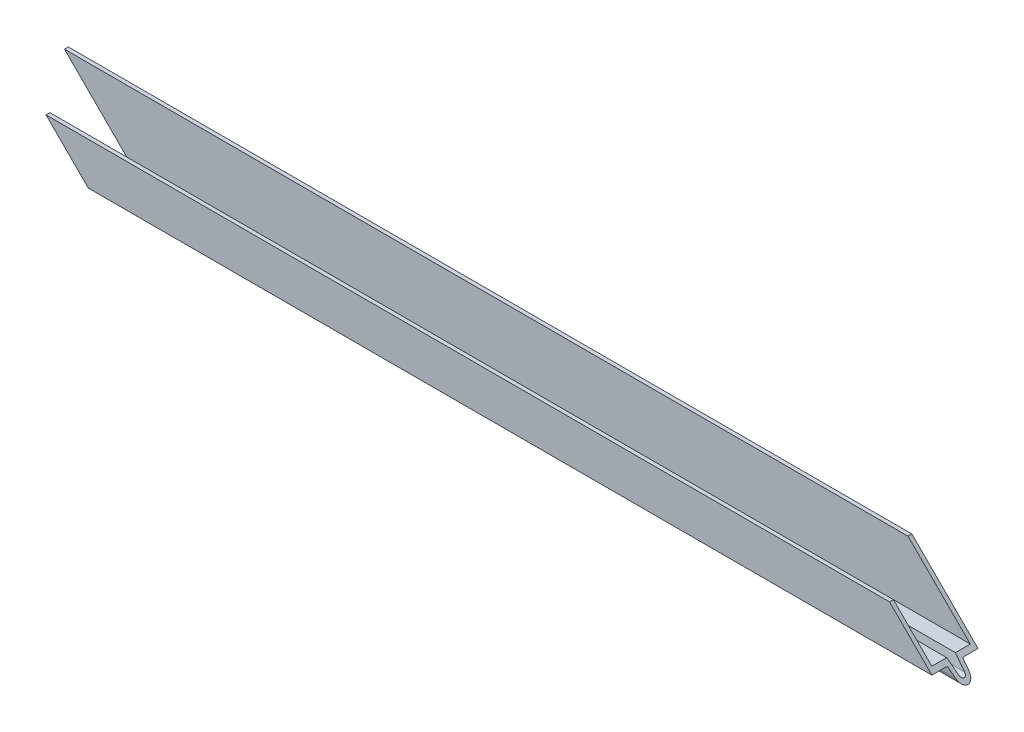
ISO-10303-21;
HEADER;
FILE_DESCRIPTION(('STEP AP214'),'2;1');
FILE_NAME('part.step','',(''),(''),'','','');
FILE_SCHEMA(('AUTOMOTIVE_DESIGN { 1 0 10303 214 1 1 1 1 }'));
ENDSEC;
DATA;
#1=APPLICATION_CONTEXT('core data for automotive mechanical design processes');
#2=APPLICATION_PROTOCOL_DEFINITION('international standard','automotive_design',2000,#1);
#3=PRODUCT_CONTEXT('',#1,'mechanical');
#4=PRODUCT('Part','Part','',(#3));
#5=PRODUCT_RELATED_PRODUCT_CATEGORY('part','',(#4));
#6=PRODUCT_DEFINITION_FORMATION('','',#4);
#7=PRODUCT_DEFINITION_CONTEXT('part definition',#1,'design');
#8=PRODUCT_DEFINITION('design','',#6,#7);
#9=PRODUCT_DEFINITION_SHAPE('','',#8);
#10=(LENGTH_UNIT() NAMED_UNIT(*) SI_UNIT(.MILLI.,.METRE.));
#11=(NAMED_UNIT(*) PLANE_ANGLE_UNIT() SI_UNIT($,.RADIAN.));
#12=(NAMED_UNIT(*) SI_UNIT($,.STERADIAN.) SOLID_ANGLE_UNIT());
#13=UNCERTAINTY_MEASURE_WITH_UNIT(LENGTH_MEASURE(1.E-05),#10,'distance_accuracy_value','');
#14=(GEOMETRIC_REPRESENTATION_CONTEXT(3) GLOBAL_UNCERTAINTY_ASSIGNED_CONTEXT((#13)) GLOBAL_UNIT_ASSIGNED_CONTEXT((#10,
#11,#12)) REPRESENTATION_CONTEXT('',''));
#15=CARTESIAN_POINT('',(0.,0.,0.));
#16=DIRECTION('',(0.,0.,1.));
#17=DIRECTION('',(1.,0.,0.));
#18=AXIS2_PLACEMENT_3D('',#15,#16,#17);
#19=CARTESIAN_POINT('',(152.4,0.,-7.62));
#20=DIRECTION('',(0.,-1.,0.));
#21=DIRECTION('',(0.,0.,-1.));
#22=AXIS2_PLACEMENT_3D('',#19,#20,#21);
#23=PLANE('',#22);
#24=DIRECTION('',(-1.,0.,0.));
#25=VECTOR('',#24,1.);
#26=CARTESIAN_POINT('',(152.4,0.,-6.35));
#27=LINE('',#26,#25);
#28=CARTESIAN_POINT('',(126.238,0.,-6.35));
#29=VERTEX_POINT('',#28);
#30=CARTESIAN_POINT('',(-152.4,0.,-6.35));
#31=VERTEX_POINT('',#30);
#32=EDGE_CURVE('E11',#29,#31,#27,.T.);
#33=ORIENTED_EDGE('',*,*,#32,.F.);
#34=DIRECTION('',(0.,0.,1.));
#35=VECTOR('',#34,1.);
#36=CARTESIAN_POINT('',(126.238,0.,-7.62));
#37=LINE('',#36,#35);
#38=CARTESIAN_POINT('',(126.238,0.,-7.62));
#39=VERTEX_POINT('',#38);
#40=EDGE_CURVE('E157',#39,#29,#37,.T.);
#41=ORIENTED_EDGE('',*,*,#40,.F.);
#42=DIRECTION('',(-1.,0.,0.));
#43=VECTOR('',#42,1.);
#44=CARTESIAN_POINT('',(152.4,0.,-7.62));
#45=LINE('',#44,#43);
#46=CARTESIAN_POINT('',(-152.4,0.,-7.62));
#47=VERTEX_POINT('',#46);
#48=EDGE_CURVE('E165',#39,#47,#45,.T.);
#49=ORIENTED_EDGE('',*,*,#48,.T.);
#50=DIRECTION('',(0.,0.,1.));
#51=VECTOR('',#50,1.);
#52=CARTESIAN_POINT('',(-152.4,0.,-7.62));
#53=LINE('',#52,#51);
#54=EDGE_CURVE('E173',#47,#31,#53,.T.);
#55=ORIENTED_EDGE('',*,*,#54,.T.);
#56=EDGE_LOOP('',(#33,#41,#49,#55));
#57=FACE_BOUND('',#56,.T.);
#58=ADVANCED_FACE('F45',(#57),#23,.F.);
#59=CARTESIAN_POINT('',(152.4,0.,-6.35));
#60=DIRECTION('',(0.,0.,-1.));
#61=DIRECTION('',(-1.,0.,0.));
#62=AXIS2_PLACEMENT_3D('',#59,#60,#61);
#63=PLANE('',#62);
#64=DIRECTION('',(-1.,0.,0.));
#65=VECTOR('',#64,1.);
#66=CARTESIAN_POINT('',(152.4,-20.574,-6.35));
#67=LINE('',#66,#65);
#68=CARTESIAN_POINT('',(146.812,-20.574,-6.35));
#69=VERTEX_POINT('',#68);
#70=CARTESIAN_POINT('',(-131.826,-20.574,-6.35));
#71=VERTEX_POINT('',#70);
#72=EDGE_CURVE('E52',#69,#71,#67,.T.);
#73=ORIENTED_EDGE('',*,*,#72,.F.);
#74=DIRECTION('',(-0.707106781186547,0.707106781186548,0.));
#75=VECTOR('',#74,1.);
#76=CARTESIAN_POINT('',(139.319,-13.081,-6.35));
#77=LINE('',#76,#75);
#78=EDGE_CURVE('E255',#69,#29,#77,.T.);
#79=ORIENTED_EDGE('',*,*,#78,.T.);
#80=ORIENTED_EDGE('',*,*,#32,.T.);
#81=DIRECTION('',(0.707106781186553,-0.707106781186542,0.));
#82=VECTOR('',#81,1.);
#83=CARTESIAN_POINT('',(2.55351295663786E-12,-152.4,-6.35));
#84=LINE('',#83,#82);
#85=EDGE_CURVE('E177',#31,#71,#84,.T.);
#86=ORIENTED_EDGE('',*,*,#85,.T.);
#87=EDGE_LOOP('',(#73,#79,#80,#86));
#88=FACE_BOUND('',#87,.T.);
#89=ADVANCED_FACE('F219',(#88),#63,.F.);
#90=CARTESIAN_POINT('',(152.4,-20.574,-6.35));
#91=DIRECTION('',(0.,-1.,0.));
#92=DIRECTION('',(0.,0.,-1.));
#93=AXIS2_PLACEMENT_3D('',#90,#91,#92);
#94=PLANE('',#93);
#95=DIRECTION('',(-1.,0.,0.));
#96=VECTOR('',#95,1.);
#97=CARTESIAN_POINT('',(152.4,-20.574,-1.4360058429734));
#98=LINE('',#97,#96);
#99=CARTESIAN_POINT('',(146.812,-20.574,-1.4360058429734));
#100=VERTEX_POINT('',#99);
#101=CARTESIAN_POINT('',(-131.826,-20.574,-1.4360058429734));
#102=VERTEX_POINT('',#101);
#103=EDGE_CURVE('E202',#100,#102,#98,.T.);
#104=ORIENTED_EDGE('',*,*,#103,.F.);
#105=DIRECTION('',(0.,0.,-1.));
#106=VECTOR('',#105,1.);
#107=CARTESIAN_POINT('',(146.812,-20.574,-6.35));
#108=LINE('',#107,#106);
#109=EDGE_CURVE('E211',#100,#69,#108,.T.);
#110=ORIENTED_EDGE('',*,*,#109,.T.);
#111=ORIENTED_EDGE('',*,*,#72,.T.);
#112=DIRECTION('',(0.,0.,1.));
#113=VECTOR('',#112,1.);
#114=CARTESIAN_POINT('',(-131.826,-20.574,-6.3499999999998));
#115=LINE('',#114,#113);
#116=EDGE_CURVE('E210',#71,#102,#115,.T.);
#117=ORIENTED_EDGE('',*,*,#116,.T.);
#118=EDGE_LOOP('',(#104,#110,#111,#117));
#119=FACE_BOUND('',#118,.T.);
#120=ADVANCED_FACE('F209',(#119),#94,.F.);
#121=CARTESIAN_POINT('',(152.4,-24.0709187171227,-0.944545967582546));
#122=DIRECTION('',(0.,-0.139173100960069,-0.99026806874157));
#123=DIRECTION('',(0.,0.99026806874157,-0.139173100960069));
#124=AXIS2_PLACEMENT_3D('',#121,#122,#123);
#125=PLANE('',#124);
#126=DIRECTION('',(-1.,0.,0.));
#127=VECTOR('',#126,1.);
#128=CARTESIAN_POINT('',(152.4,-24.0709187171227,-0.944545967582547));
#129=LINE('',#128,#127);
#130=CARTESIAN_POINT('',(150.308918717123,-24.0709187171227,-0.944545967582547));
#131=VERTEX_POINT('',#130);
#132=CARTESIAN_POINT('',(-128.329081282877,-24.0709187171227,-0.944545967582547));
#133=VERTEX_POINT('',#132);
#134=EDGE_CURVE('E200',#131,#133,#129,.T.);
#135=ORIENTED_EDGE('',*,*,#134,.F.);
#136=DIRECTION('',(-0.703640787534026,0.703640787534027,-0.0988902636106829));
#137=VECTOR('',#136,1.);
#138=CARTESIAN_POINT('',(151.344234719447,-25.1062347194474,-0.799041792435087));
#139=LINE('',#138,#137);
#140=EDGE_CURVE('E259',#131,#100,#139,.T.);
#141=ORIENTED_EDGE('',*,*,#140,.T.);
#142=ORIENTED_EDGE('',*,*,#103,.T.);
#143=DIRECTION('',(0.703640787534032,-0.703640787534021,0.0988902636106821));
#144=VECTOR('',#143,1.);
#145=CARTESIAN_POINT('',(10.6627946188367,-163.062794618834,18.5894882884957));
#146=LINE('',#145,#144);
#147=EDGE_CURVE('E217',#102,#133,#146,.T.);
#148=ORIENTED_EDGE('',*,*,#147,.T.);
#149=EDGE_LOOP('',(#135,#141,#142,#148));
#150=FACE_BOUND('',#149,.T.);
#151=ADVANCED_FACE('F321',(#150),#125,.F.);
#152=CARTESIAN_POINT('',(152.4,-23.9381714384239,0.));
#153=DIRECTION('',(-1.,0.,0.));
#154=DIRECTION('',(0.,0.,1.));
#155=AXIS2_PLACEMENT_3D('',#152,#153,#154);
#156=CYLINDRICAL_SURFACE('',#155,0.95382856157613);
#157=DIRECTION('',(-1.,0.,0.));
#158=VECTOR('',#157,1.);
#159=CARTESIAN_POINT('',(152.4,-24.0709187171227,0.944545967582541));
#160=LINE('',#159,#158);
#161=CARTESIAN_POINT('',(150.308918717123,-24.0709187171227,0.944545967582541));
#162=VERTEX_POINT('',#161);
#163=CARTESIAN_POINT('',(-128.329081282877,-24.0709187171227,0.944545967582543));
#164=VERTEX_POINT('',#163);
#165=EDGE_CURVE('E198',#162,#164,#160,.T.);
#166=ORIENTED_EDGE('',*,*,#165,.F.);
#167=CARTESIAN_POINT('',(150.176171438424,-23.9381714384239,0.));
#168=DIRECTION('',(-0.707106781186548,-0.707106781186547,0.));
#169=DIRECTION('',(-0.707106781186547,0.707106781186548,0.));
#170=AXIS2_PLACEMENT_3D('',#167,#168,#169);
#171=ELLIPSE('',#170,1.34891728795978,0.95382856157613);
#172=EDGE_CURVE('E262',#162,#131,#171,.F.);
#173=ORIENTED_EDGE('',*,*,#172,.T.);
#174=ORIENTED_EDGE('',*,*,#134,.T.);
#175=CARTESIAN_POINT('',(-128.461828561576,-23.9381714384239,0.));
#176=DIRECTION('',(0.707106781186542,0.707106781186553,0.));
#177=DIRECTION('',(-0.707106781186553,0.707106781186542,0.));
#178=AXIS2_PLACEMENT_3D('',#175,#176,#177);
#179=ELLIPSE('',#178,1.3489172879598,0.95382856157613);
#180=EDGE_CURVE('E222',#133,#164,#179,.F.);
#181=ORIENTED_EDGE('',*,*,#180,.T.);
#182=EDGE_LOOP('',(#166,#173,#174,#181));
#183=FACE_BOUND('',#182,.T.);
#184=ADVANCED_FACE('F318',(#183),#156,.F.);
#185=CARTESIAN_POINT('',(152.4,-20.574,1.43600584297339));
#186=DIRECTION('',(0.,-0.139173100960069,0.99026806874157));
#187=DIRECTION('',(0.,-0.99026806874157,-0.139173100960069));
#188=AXIS2_PLACEMENT_3D('',#185,#186,#187);
#189=PLANE('',#188);
#190=DIRECTION('',(-1.,0.,0.));
#191=VECTOR('',#190,1.);
#192=CARTESIAN_POINT('',(152.4,-20.574,1.43600584297339));
#193=LINE('',#192,#191);
#194=CARTESIAN_POINT('',(146.812,-20.574,1.43600584297339));
#195=VERTEX_POINT('',#194);
#196=CARTESIAN_POINT('',(-131.826,-20.574,1.43600584297339));
#197=VERTEX_POINT('',#196);
#198=EDGE_CURVE('E196',#195,#197,#193,.T.);
#199=ORIENTED_EDGE('',*,*,#198,.F.);
#200=DIRECTION('',(0.703640787534026,-0.703640787534027,-0.0988902636106828));
#201=VECTOR('',#200,1.);
#202=CARTESIAN_POINT('',(149.578676679842,-23.3406766798418,1.04717479303677));
#203=LINE('',#202,#201);
#204=EDGE_CURVE('E265',#195,#162,#203,.T.);
#205=ORIENTED_EDGE('',*,*,#204,.T.);
#206=ORIENTED_EDGE('',*,*,#165,.T.);
#207=DIRECTION('',(-0.703640787534032,0.703640787534021,0.098890263610682));
#208=VECTOR('',#207,1.);
#209=CARTESIAN_POINT('',(8.89723657923114,-161.297236579228,-18.341355287894));
#210=LINE('',#209,#208);
#211=EDGE_CURVE('E225',#164,#197,#210,.T.);
#212=ORIENTED_EDGE('',*,*,#211,.T.);
#213=EDGE_LOOP('',(#199,#205,#206,#212));
#214=FACE_BOUND('',#213,.T.);
#215=ADVANCED_FACE('F315',(#214),#189,.F.);
#216=CARTESIAN_POINT('',(152.4,-20.574,1.43600584297339));
#217=DIRECTION('',(0.,-1.,0.));
#218=DIRECTION('',(0.,0.,-1.));
#219=AXIS2_PLACEMENT_3D('',#216,#217,#218);
#220=PLANE('',#219);
#221=DIRECTION('',(-1.,0.,0.));
#222=VECTOR('',#221,1.);
#223=CARTESIAN_POINT('',(152.4,-20.574,6.35));
#224=LINE('',#223,#222);
#225=CARTESIAN_POINT('',(146.812,-20.574,6.35));
#226=VERTEX_POINT('',#225);
#227=CARTESIAN_POINT('',(-131.826,-20.574,6.35));
#228=VERTEX_POINT('',#227);
#229=EDGE_CURVE('E194',#226,#228,#224,.T.);
#230=ORIENTED_EDGE('',*,*,#229,.F.);
#231=DIRECTION('',(0.,0.,-1.));
#232=VECTOR('',#231,1.);
#233=CARTESIAN_POINT('',(146.812,-20.574,1.43600584297339));
#234=LINE('',#233,#232);
#235=EDGE_CURVE('E268',#226,#195,#234,.T.);
#236=ORIENTED_EDGE('',*,*,#235,.T.);
#237=ORIENTED_EDGE('',*,*,#198,.T.);
#238=DIRECTION('',(0.,0.,1.));
#239=VECTOR('',#238,1.);
#240=CARTESIAN_POINT('',(-131.826,-20.574,1.43600584297319));
#241=LINE('',#240,#239);
#242=EDGE_CURVE('E228',#197,#228,#241,.T.);
#243=ORIENTED_EDGE('',*,*,#242,.T.);
#244=EDGE_LOOP('',(#230,#236,#237,#243));
#245=FACE_BOUND('',#244,.T.);
#246=ADVANCED_FACE('F312',(#245),#220,.F.);
#247=CARTESIAN_POINT('',(152.4,-20.574,6.35));
#248=DIRECTION('',(0.,0.,1.));
#249=DIRECTION('',(0.,-1.,0.));
#250=AXIS2_PLACEMENT_3D('',#247,#248,#249);
#251=PLANE('',#250);
#252=DIRECTION('',(-1.,0.,0.));
#253=VECTOR('',#252,1.);
#254=CARTESIAN_POINT('',(152.4,-7.874,6.35));
#255=LINE('',#254,#253);
#256=CARTESIAN_POINT('',(134.112,-7.874,6.35));
#257=VERTEX_POINT('',#256);
#258=CARTESIAN_POINT('',(-144.526,-7.874,6.35));
#259=VERTEX_POINT('',#258);
#260=EDGE_CURVE('E192',#257,#259,#255,.T.);
#261=ORIENTED_EDGE('',*,*,#260,.F.);
#262=DIRECTION('',(0.707106781186547,-0.707106781186548,0.));
#263=VECTOR('',#262,1.);
#264=CARTESIAN_POINT('',(149.606,-23.368,6.35));
#265=LINE('',#264,#263);
#266=EDGE_CURVE('E271',#257,#226,#265,.T.);
#267=ORIENTED_EDGE('',*,*,#266,.T.);
#268=ORIENTED_EDGE('',*,*,#229,.T.);
#269=DIRECTION('',(-0.707106781186553,0.707106781186542,0.));
#270=VECTOR('',#269,1.);
#271=CARTESIAN_POINT('',(10.2870000000025,-162.687,6.34999999999998));
#272=LINE('',#271,#270);
#273=EDGE_CURVE('E231',#228,#259,#272,.T.);
#274=ORIENTED_EDGE('',*,*,#273,.T.);
#275=EDGE_LOOP('',(#261,#267,#268,#274));
#276=FACE_BOUND('',#275,.T.);
#277=ADVANCED_FACE('F307',(#276),#251,.F.);
#278=CARTESIAN_POINT('',(152.4,-7.874,7.62));
#279=DIRECTION('',(0.,-1.,0.));
#280=DIRECTION('',(0.,0.,-1.));
#281=AXIS2_PLACEMENT_3D('',#278,#279,#280);
#282=PLANE('',#281);
#283=DIRECTION('',(-1.,0.,0.));
#284=VECTOR('',#283,1.);
#285=CARTESIAN_POINT('',(152.4,-7.874,7.62));
#286=LINE('',#285,#284);
#287=CARTESIAN_POINT('',(134.112,-7.87399999999999,7.62));
#288=VERTEX_POINT('',#287);
#289=CARTESIAN_POINT('',(-144.526,-7.87399999999998,7.62));
#290=VERTEX_POINT('',#289);
#291=EDGE_CURVE('E190',#288,#290,#286,.T.);
#292=ORIENTED_EDGE('',*,*,#291,.F.);
#293=DIRECTION('',(0.,0.,-1.));
#294=VECTOR('',#293,1.);
#295=CARTESIAN_POINT('',(134.112,-7.874,7.62));
#296=LINE('',#295,#294);
#297=EDGE_CURVE('E274',#288,#257,#296,.T.);
#298=ORIENTED_EDGE('',*,*,#297,.T.);
#299=ORIENTED_EDGE('',*,*,#260,.T.);
#300=DIRECTION('',(0.,0.,1.));
#301=VECTOR('',#300,1.);
#302=CARTESIAN_POINT('',(-144.526,-7.874,7.62));
#303=LINE('',#302,#301);
#304=EDGE_CURVE('E234',#259,#290,#303,.T.);
#305=ORIENTED_EDGE('',*,*,#304,.T.);
#306=EDGE_LOOP('',(#292,#298,#299,#305));
#307=FACE_BOUND('',#306,.T.);
#308=ADVANCED_FACE('F304',(#307),#282,.F.);
#309=CARTESIAN_POINT('',(152.4,-21.844,7.62));
#310=DIRECTION('',(0.,0.,-1.));
#311=DIRECTION('',(-1.,0.,0.));
#312=AXIS2_PLACEMENT_3D('',#309,#310,#311);
#313=PLANE('',#312);
#314=DIRECTION('',(-1.,0.,0.));
#315=VECTOR('',#314,1.);
#316=CARTESIAN_POINT('',(152.4,-21.844,7.62));
#317=LINE('',#316,#315);
#318=CARTESIAN_POINT('',(148.082,-21.844,7.62));
#319=VERTEX_POINT('',#318);
#320=CARTESIAN_POINT('',(-130.556,-21.844,7.62));
#321=VERTEX_POINT('',#320);
#322=EDGE_CURVE('E188',#319,#321,#317,.T.);
#323=ORIENTED_EDGE('',*,*,#322,.F.);
#324=DIRECTION('',(0.707106781186547,-0.707106781186548,0.));
#325=VECTOR('',#324,1.);
#326=CARTESIAN_POINT('',(152.4,-26.162,7.62));
#327=LINE('',#326,#325);
#328=EDGE_CURVE('E161',#288,#319,#327,.T.);
#329=ORIENTED_EDGE('',*,*,#328,.F.);
#330=ORIENTED_EDGE('',*,*,#291,.T.);
#331=DIRECTION('',(-0.707106781186554,0.707106781186542,0.));
#332=VECTOR('',#331,1.);
#333=CARTESIAN_POINT('',(-152.4,0.,7.62));
#334=LINE('',#333,#332);
#335=EDGE_CURVE('E252',#321,#290,#334,.T.);
#336=ORIENTED_EDGE('',*,*,#335,.F.);
#337=EDGE_LOOP('',(#323,#329,#330,#336));
#338=FACE_BOUND('',#337,.T.);
#339=ADVANCED_FACE('F299',(#338),#313,.F.);
#340=CARTESIAN_POINT('',(152.4,-21.844,2.54));
#341=DIRECTION('',(0.,1.,0.));
#342=DIRECTION('',(0.,0.,1.));
#343=AXIS2_PLACEMENT_3D('',#340,#341,#342);
#344=PLANE('',#343);
#345=DIRECTION('',(-1.,0.,0.));
#346=VECTOR('',#345,1.);
#347=CARTESIAN_POINT('',(152.4,-21.844,2.54));
#348=LINE('',#347,#346);
#349=CARTESIAN_POINT('',(148.082,-21.844,2.54));
#350=VERTEX_POINT('',#349);
#351=CARTESIAN_POINT('',(-130.556,-21.844,2.54));
#352=VERTEX_POINT('',#351);
#353=EDGE_CURVE('E186',#350,#352,#348,.T.);
#354=ORIENTED_EDGE('',*,*,#353,.F.);
#355=DIRECTION('',(0.,0.,1.));
#356=VECTOR('',#355,1.);
#357=CARTESIAN_POINT('',(148.082,-21.844,2.53999999999999));
#358=LINE('',#357,#356);
#359=EDGE_CURVE('E277',#350,#319,#358,.T.);
#360=ORIENTED_EDGE('',*,*,#359,.T.);
#361=ORIENTED_EDGE('',*,*,#322,.T.);
#362=DIRECTION('',(0.,0.,-1.));
#363=VECTOR('',#362,1.);
#364=CARTESIAN_POINT('',(-130.556,-21.844,2.5399999999998));
#365=LINE('',#364,#363);
#366=EDGE_CURVE('E237',#321,#352,#365,.T.);
#367=ORIENTED_EDGE('',*,*,#366,.T.);
#368=EDGE_LOOP('',(#354,#360,#361,#367));
#369=FACE_BOUND('',#368,.T.);
#370=ADVANCED_FACE('F296',(#369),#344,.F.);
#371=CARTESIAN_POINT('',(152.4,-21.844,2.54));
#372=DIRECTION('',(0.,0.13917310096007,-0.99026806874157));
#373=DIRECTION('',(0.,0.99026806874157,0.13917310096007));
#374=AXIS2_PLACEMENT_3D('',#371,#372,#373);
#375=PLANE('',#374);
#376=DIRECTION('',(-1.,0.,0.));
#377=VECTOR('',#376,1.);
#378=CARTESIAN_POINT('',(152.4,-24.247668555342,2.20218641488433));
#379=LINE('',#378,#377);
#380=CARTESIAN_POINT('',(150.485668555342,-24.247668555342,2.20218641488433));
#381=VERTEX_POINT('',#380);
#382=CARTESIAN_POINT('',(-128.152331444658,-24.247668555342,2.20218641488433));
#383=VERTEX_POINT('',#382);
#384=EDGE_CURVE('E184',#381,#383,#379,.T.);
#385=ORIENTED_EDGE('',*,*,#384,.F.);
#386=DIRECTION('',(-0.703640787534026,0.703640787534027,0.0988902636106832));
#387=VECTOR('',#386,1.);
#388=CARTESIAN_POINT('',(150.219886525332,-23.9818865253323,2.23953964323079));
#389=LINE('',#388,#387);
#390=EDGE_CURVE('E280',#381,#350,#389,.T.);
#391=ORIENTED_EDGE('',*,*,#390,.T.);
#392=ORIENTED_EDGE('',*,*,#353,.T.);
#393=DIRECTION('',(0.703640787534032,-0.703640787534021,-0.0988902636106823));
#394=VECTOR('',#393,1.);
#395=CARTESIAN_POINT('',(9.53844642472165,-161.938446424719,-17.1489904377001));
#396=LINE('',#395,#394);
#397=EDGE_CURVE('E240',#352,#383,#396,.T.);
#398=ORIENTED_EDGE('',*,*,#397,.T.);
#399=EDGE_LOOP('',(#385,#391,#392,#398));
#400=FACE_BOUND('',#399,.T.);
#401=ADVANCED_FACE('F399',(#400),#375,.F.);
#402=CARTESIAN_POINT('',(152.4,-23.9381714384239,0.));
#403=DIRECTION('',(-1.,0.,0.));
#404=DIRECTION('',(0.,0.,1.));
#405=AXIS2_PLACEMENT_3D('',#402,#403,#404);
#406=CYLINDRICAL_SURFACE('',#405,2.22382856157613);
#407=DIRECTION('',(-1.,0.,0.));
#408=VECTOR('',#407,1.);
#409=CARTESIAN_POINT('',(152.4,-24.247668555342,-2.20218641488434));
#410=LINE('',#409,#408);
#411=CARTESIAN_POINT('',(150.485668555342,-24.247668555342,-2.20218641488434));
#412=VERTEX_POINT('',#411);
#413=CARTESIAN_POINT('',(-128.152331444658,-24.247668555342,-2.20218641488434));
#414=VERTEX_POINT('',#413);
#415=EDGE_CURVE('E182',#412,#414,#410,.T.);
#416=ORIENTED_EDGE('',*,*,#415,.F.);
#417=CARTESIAN_POINT('',(150.176171438424,-23.9381714384239,0.));
#418=DIRECTION('',(-0.707106781186548,-0.707106781186547,0.));
#419=DIRECTION('',(-0.707106781186547,0.707106781186548,0.));
#420=AXIS2_PLACEMENT_3D('',#417,#418,#419);
#421=ELLIPSE('',#420,3.14496851217361,2.22382856157613);
#422=EDGE_CURVE('E283',#412,#381,#421,.T.);
#423=ORIENTED_EDGE('',*,*,#422,.T.);
#424=ORIENTED_EDGE('',*,*,#384,.T.);
#425=CARTESIAN_POINT('',(-128.461828561576,-23.9381714384239,0.));
#426=DIRECTION('',(0.707106781186542,0.707106781186553,0.));
#427=DIRECTION('',(-0.707106781186553,0.707106781186542,0.));
#428=AXIS2_PLACEMENT_3D('',#425,#426,#427);
#429=ELLIPSE('',#428,3.14496851217364,2.22382856157613);
#430=EDGE_CURVE('E243',#383,#414,#429,.T.);
#431=ORIENTED_EDGE('',*,*,#430,.T.);
#432=EDGE_LOOP('',(#416,#423,#424,#431));
#433=FACE_BOUND('',#432,.T.);
#434=ADVANCED_FACE('F408',(#433),#406,.T.);
#435=CARTESIAN_POINT('',(152.4,-24.247668555342,-2.20218641488434));
#436=DIRECTION('',(0.,0.139173100960069,0.99026806874157));
#437=DIRECTION('',(0.,-0.99026806874157,0.139173100960069));
#438=AXIS2_PLACEMENT_3D('',#435,#436,#437);
#439=PLANE('',#438);
#440=DIRECTION('',(-1.,0.,0.));
#441=VECTOR('',#440,1.);
#442=CARTESIAN_POINT('',(152.4,-21.844,-2.54));
#443=LINE('',#442,#441);
#444=CARTESIAN_POINT('',(148.082,-21.844,-2.54));
#445=VERTEX_POINT('',#444);
#446=CARTESIAN_POINT('',(-130.556,-21.844,-2.54));
#447=VERTEX_POINT('',#446);
#448=EDGE_CURVE('E175',#445,#447,#443,.T.);
#449=ORIENTED_EDGE('',*,*,#448,.F.);
#450=DIRECTION('',(0.703640787534026,-0.703640787534027,0.0988902636106829));
#451=VECTOR('',#450,1.);
#452=CARTESIAN_POINT('',(151.43347388201,-25.1954738820104,-2.06898106313898));
#453=LINE('',#452,#451);
#454=EDGE_CURVE('E285',#445,#412,#453,.T.);
#455=ORIENTED_EDGE('',*,*,#454,.T.);
#456=ORIENTED_EDGE('',*,*,#415,.T.);
#457=DIRECTION('',(-0.703640787534032,0.703640787534021,-0.0988902636106821));
#458=VECTOR('',#457,1.);
#459=CARTESIAN_POINT('',(10.7520337813997,-163.152033781397,17.3195490177918));
#460=LINE('',#459,#458);
#461=EDGE_CURVE('E246',#414,#447,#460,.T.);
#462=ORIENTED_EDGE('',*,*,#461,.T.);
#463=EDGE_LOOP('',(#449,#455,#456,#462));
#464=FACE_BOUND('',#463,.T.);
#465=ADVANCED_FACE('F418',(#464),#439,.F.);
#466=CARTESIAN_POINT('',(152.4,-21.844,-7.62));
#467=DIRECTION('',(0.,1.,0.));
#468=DIRECTION('',(0.,0.,1.));
#469=AXIS2_PLACEMENT_3D('',#466,#467,#468);
#470=PLANE('',#469);
#471=DIRECTION('',(-1.,0.,0.));
#472=VECTOR('',#471,1.);
#473=CARTESIAN_POINT('',(152.4,-21.844,-7.62));
#474=LINE('',#473,#472);
#475=CARTESIAN_POINT('',(148.082,-21.844,-7.62));
#476=VERTEX_POINT('',#475);
#477=CARTESIAN_POINT('',(-130.556,-21.844,-7.62));
#478=VERTEX_POINT('',#477);
#479=EDGE_CURVE('E172',#476,#478,#474,.T.);
#480=ORIENTED_EDGE('',*,*,#479,.F.);
#481=DIRECTION('',(0.,0.,1.));
#482=VECTOR('',#481,1.);
#483=CARTESIAN_POINT('',(148.082,-21.844,-7.62));
#484=LINE('',#483,#482);
#485=EDGE_CURVE('E59',#476,#445,#484,.T.);
#486=ORIENTED_EDGE('',*,*,#485,.T.);
#487=ORIENTED_EDGE('',*,*,#448,.T.);
#488=DIRECTION('',(0.,0.,-1.));
#489=VECTOR('',#488,1.);
#490=CARTESIAN_POINT('',(-130.556,-21.844,-7.61999999999981));
#491=LINE('',#490,#489);
#492=EDGE_CURVE('E249',#447,#478,#491,.T.);
#493=ORIENTED_EDGE('',*,*,#492,.T.);
#494=EDGE_LOOP('',(#480,#486,#487,#493));
#495=FACE_BOUND('',#494,.T.);
#496=ADVANCED_FACE('F428',(#495),#470,.F.);
#497=CARTESIAN_POINT('',(152.4,0.,-7.62));
#498=DIRECTION('',(0.,0.,1.));
#499=DIRECTION('',(0.,-1.,0.));
#500=AXIS2_PLACEMENT_3D('',#497,#498,#499);
#501=PLANE('',#500);
#502=ORIENTED_EDGE('',*,*,#48,.F.);
#503=DIRECTION('',(0.707106781186547,-0.707106781186548,0.));
#504=VECTOR('',#503,1.);
#505=CARTESIAN_POINT('',(152.4,-26.162,-7.62));
#506=LINE('',#505,#504);
#507=EDGE_CURVE('E154',#39,#476,#506,.T.);
#508=ORIENTED_EDGE('',*,*,#507,.T.);
#509=ORIENTED_EDGE('',*,*,#479,.T.);
#510=DIRECTION('',(-0.707106781186554,0.707106781186542,0.));
#511=VECTOR('',#510,1.);
#512=CARTESIAN_POINT('',(-152.4,0.,-7.62));
#513=LINE('',#512,#511);
#514=EDGE_CURVE('E171',#478,#47,#513,.T.);
#515=ORIENTED_EDGE('',*,*,#514,.T.);
#516=EDGE_LOOP('',(#502,#508,#509,#515));
#517=FACE_BOUND('',#516,.T.);
#518=ADVANCED_FACE('F169',(#517),#501,.F.);
#519=CARTESIAN_POINT('',(-152.4,0.,-7.62));
#520=DIRECTION('',(0.707106781186542,0.707106781186553,0.));
#521=DIRECTION('',(-0.707106781186553,0.707106781186542,0.));
#522=AXIS2_PLACEMENT_3D('',#519,#520,#521);
#523=PLANE('',#522);
#524=ORIENTED_EDGE('',*,*,#54,.F.);
#525=ORIENTED_EDGE('',*,*,#514,.F.);
#526=ORIENTED_EDGE('',*,*,#492,.F.);
#527=ORIENTED_EDGE('',*,*,#461,.F.);
#528=ORIENTED_EDGE('',*,*,#430,.F.);
#529=ORIENTED_EDGE('',*,*,#397,.F.);
#530=ORIENTED_EDGE('',*,*,#366,.F.);
#531=ORIENTED_EDGE('',*,*,#335,.T.);
#532=ORIENTED_EDGE('',*,*,#304,.F.);
#533=ORIENTED_EDGE('',*,*,#273,.F.);
#534=ORIENTED_EDGE('',*,*,#242,.F.);
#535=ORIENTED_EDGE('',*,*,#211,.F.);
#536=ORIENTED_EDGE('',*,*,#180,.F.);
#537=ORIENTED_EDGE('',*,*,#147,.F.);
#538=ORIENTED_EDGE('',*,*,#116,.F.);
#539=ORIENTED_EDGE('',*,*,#85,.F.);
#540=EDGE_LOOP('',(#524,#525,#526,#527,#528,#529,#530,#531,#532,#533,#534,#535,#536,#537,#538,#539));
#541=FACE_BOUND('',#540,.T.);
#542=ADVANCED_FACE('F214',(#541),#523,.F.);
#543=CARTESIAN_POINT('',(152.4,-26.162,-7.62));
#544=DIRECTION('',(-0.707106781186548,-0.707106781186547,0.));
#545=DIRECTION('',(0.707106781186547,-0.707106781186548,0.));
#546=AXIS2_PLACEMENT_3D('',#543,#544,#545);
#547=PLANE('',#546);
#548=ORIENTED_EDGE('',*,*,#109,.F.);
#549=ORIENTED_EDGE('',*,*,#140,.F.);
#550=ORIENTED_EDGE('',*,*,#172,.F.);
#551=ORIENTED_EDGE('',*,*,#204,.F.);
#552=ORIENTED_EDGE('',*,*,#235,.F.);
#553=ORIENTED_EDGE('',*,*,#266,.F.);
#554=ORIENTED_EDGE('',*,*,#297,.F.);
#555=ORIENTED_EDGE('',*,*,#328,.T.);
#556=ORIENTED_EDGE('',*,*,#359,.F.);
#557=ORIENTED_EDGE('',*,*,#390,.F.);
#558=ORIENTED_EDGE('',*,*,#422,.F.);
#559=ORIENTED_EDGE('',*,*,#454,.F.);
#560=ORIENTED_EDGE('',*,*,#485,.F.);
#561=ORIENTED_EDGE('',*,*,#507,.F.);
#562=ORIENTED_EDGE('',*,*,#40,.T.);
#563=ORIENTED_EDGE('',*,*,#78,.F.);
#564=EDGE_LOOP('',(#548,#549,#550,#551,#552,#553,#554,#555,#556,#557,#558,#559,#560,#561,#562,#563));
#565=FACE_BOUND('',#564,.T.);
#566=ADVANCED_FACE('F156',(#565),#547,.F.);
#567=CLOSED_SHELL('',(#58,#89,#120,#151,#184,#215,#246,#277,#308,#339,#370,#401,#434,#465,#496,
#518,#542,#566));
#568=MANIFOLD_SOLID_BREP('B2',#567);
#569=ADVANCED_BREP_SHAPE_REPRESENTATION('',(#18,#568),#14);
#570=SHAPE_DEFINITION_REPRESENTATION(#9,#569);
ENDSEC;
END-ISO-10303-21;
